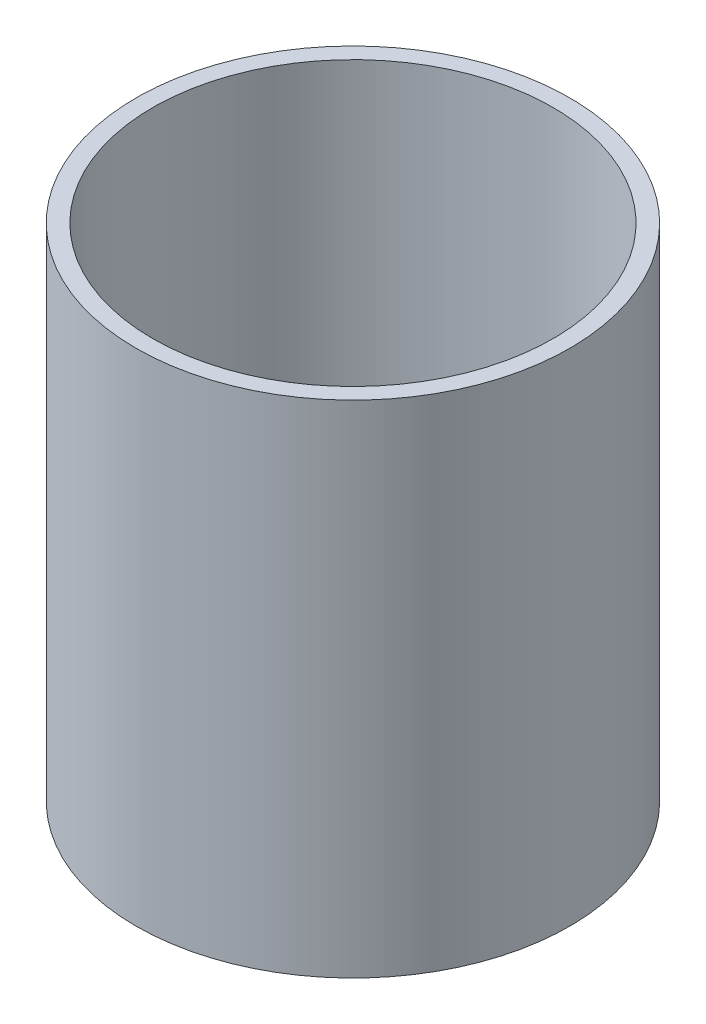
ISO-10303-21;
HEADER;
FILE_DESCRIPTION(('STEP AP214'),'2;1');
FILE_NAME('part.step','',(''),(''),'','','');
FILE_SCHEMA(('AUTOMOTIVE_DESIGN { 1 0 10303 214 1 1 1 1 }'));
ENDSEC;
DATA;
#1=APPLICATION_CONTEXT('core data for automotive mechanical design processes');
#2=APPLICATION_PROTOCOL_DEFINITION('international standard','automotive_design',2000,#1);
#3=PRODUCT_CONTEXT('',#1,'mechanical');
#4=PRODUCT('Part','Part','',(#3));
#5=PRODUCT_RELATED_PRODUCT_CATEGORY('part','',(#4));
#6=PRODUCT_DEFINITION_FORMATION('','',#4);
#7=PRODUCT_DEFINITION_CONTEXT('part definition',#1,'design');
#8=PRODUCT_DEFINITION('design','',#6,#7);
#9=PRODUCT_DEFINITION_SHAPE('','',#8);
#10=(LENGTH_UNIT() NAMED_UNIT(*) SI_UNIT(.MILLI.,.METRE.));
#11=(NAMED_UNIT(*) PLANE_ANGLE_UNIT() SI_UNIT($,.RADIAN.));
#12=(NAMED_UNIT(*) SI_UNIT($,.STERADIAN.) SOLID_ANGLE_UNIT());
#13=UNCERTAINTY_MEASURE_WITH_UNIT(LENGTH_MEASURE(1.E-05),#10,'distance_accuracy_value','');
#14=(GEOMETRIC_REPRESENTATION_CONTEXT(3) GLOBAL_UNCERTAINTY_ASSIGNED_CONTEXT((#13)) GLOBAL_UNIT_ASSIGNED_CONTEXT((#10,
#11,#12)) REPRESENTATION_CONTEXT('',''));
#15=CARTESIAN_POINT('',(0.,0.,0.));
#16=DIRECTION('',(0.,0.,1.));
#17=DIRECTION('',(1.,0.,0.));
#18=AXIS2_PLACEMENT_3D('',#15,#16,#17);
#19=CARTESIAN_POINT('',(0.,60.,0.));
#20=DIRECTION('',(0.,1.,0.));
#21=DIRECTION('',(0.,0.,1.));
#22=AXIS2_PLACEMENT_3D('',#19,#20,#21);
#23=PLANE('',#22);
#24=CARTESIAN_POINT('',(0.,60.,0.));
#25=DIRECTION('',(0.,1.,0.));
#26=DIRECTION('',(0.,0.,1.));
#27=AXIS2_PLACEMENT_3D('',#24,#25,#26);
#28=CIRCLE('',#27,26.);
#29=CARTESIAN_POINT('',(0.,60.,26.));
#30=VERTEX_POINT('',#29);
#31=EDGE_CURVE('E10',#30,#30,#28,.T.);
#32=ORIENTED_EDGE('',*,*,#31,.T.);
#33=EDGE_LOOP('',(#32));
#34=FACE_BOUND('',#33,.T.);
#35=CARTESIAN_POINT('',(0.,60.,0.));
#36=DIRECTION('',(0.,1.,0.));
#37=DIRECTION('',(0.,0.,1.));
#38=AXIS2_PLACEMENT_3D('',#35,#36,#37);
#39=CIRCLE('',#38,24.);
#40=CARTESIAN_POINT('',(0.,60.,24.));
#41=VERTEX_POINT('',#40);
#42=EDGE_CURVE('E42',#41,#41,#39,.T.);
#43=ORIENTED_EDGE('',*,*,#42,.F.);
#44=EDGE_LOOP('',(#43));
#45=FACE_BOUND('',#44,.T.);
#46=ADVANCED_FACE('F31',(#34,#45),#23,.T.);
#47=CARTESIAN_POINT('',(0.,0.,0.));
#48=DIRECTION('',(0.,1.,0.));
#49=DIRECTION('',(0.,0.,1.));
#50=AXIS2_PLACEMENT_3D('',#47,#48,#49);
#51=PLANE('',#50);
#52=CARTESIAN_POINT('',(0.,0.,0.));
#53=DIRECTION('',(0.,1.,0.));
#54=DIRECTION('',(0.,0.,1.));
#55=AXIS2_PLACEMENT_3D('',#52,#53,#54);
#56=CIRCLE('',#55,26.);
#57=CARTESIAN_POINT('',(0.,0.,26.));
#58=VERTEX_POINT('',#57);
#59=EDGE_CURVE('E35',#58,#58,#56,.T.);
#60=ORIENTED_EDGE('',*,*,#59,.F.);
#61=EDGE_LOOP('',(#60));
#62=FACE_BOUND('',#61,.T.);
#63=CARTESIAN_POINT('',(0.,0.,0.));
#64=DIRECTION('',(0.,1.,0.));
#65=DIRECTION('',(0.,0.,1.));
#66=AXIS2_PLACEMENT_3D('',#63,#64,#65);
#67=CIRCLE('',#66,24.);
#68=CARTESIAN_POINT('',(0.,0.,24.));
#69=VERTEX_POINT('',#68);
#70=EDGE_CURVE('E44',#69,#69,#67,.T.);
#71=ORIENTED_EDGE('',*,*,#70,.T.);
#72=EDGE_LOOP('',(#71));
#73=FACE_BOUND('',#72,.T.);
#74=ADVANCED_FACE('F54',(#62,#73),#51,.F.);
#75=CARTESIAN_POINT('',(0.,60.,0.));
#76=DIRECTION('',(0.,-1.,0.));
#77=DIRECTION('',(0.,0.,-1.));
#78=AXIS2_PLACEMENT_3D('',#75,#76,#77);
#79=CYLINDRICAL_SURFACE('',#78,26.);
#80=ORIENTED_EDGE('',*,*,#31,.F.);
#81=EDGE_LOOP('',(#80));
#82=FACE_BOUND('',#81,.T.);
#83=ORIENTED_EDGE('',*,*,#59,.T.);
#84=EDGE_LOOP('',(#83));
#85=FACE_BOUND('',#84,.T.);
#86=ADVANCED_FACE('F33',(#82,#85),#79,.T.);
#87=CARTESIAN_POINT('',(0.,60.,0.));
#88=DIRECTION('',(0.,-1.,0.));
#89=DIRECTION('',(0.,0.,-1.));
#90=AXIS2_PLACEMENT_3D('',#87,#88,#89);
#91=CYLINDRICAL_SURFACE('',#90,24.);
#92=ORIENTED_EDGE('',*,*,#42,.T.);
#93=EDGE_LOOP('',(#92));
#94=FACE_BOUND('',#93,.T.);
#95=ORIENTED_EDGE('',*,*,#70,.F.);
#96=EDGE_LOOP('',(#95));
#97=FACE_BOUND('',#96,.T.);
#98=ADVANCED_FACE('F50',(#94,#97),#91,.F.);
#99=CLOSED_SHELL('',(#46,#74,#86,#98));
#100=MANIFOLD_SOLID_BREP('B2',#99);
#101=ADVANCED_BREP_SHAPE_REPRESENTATION('',(#18,#100),#14);
#102=SHAPE_DEFINITION_REPRESENTATION(#9,#101);
ENDSEC;
END-ISO-10303-21;
